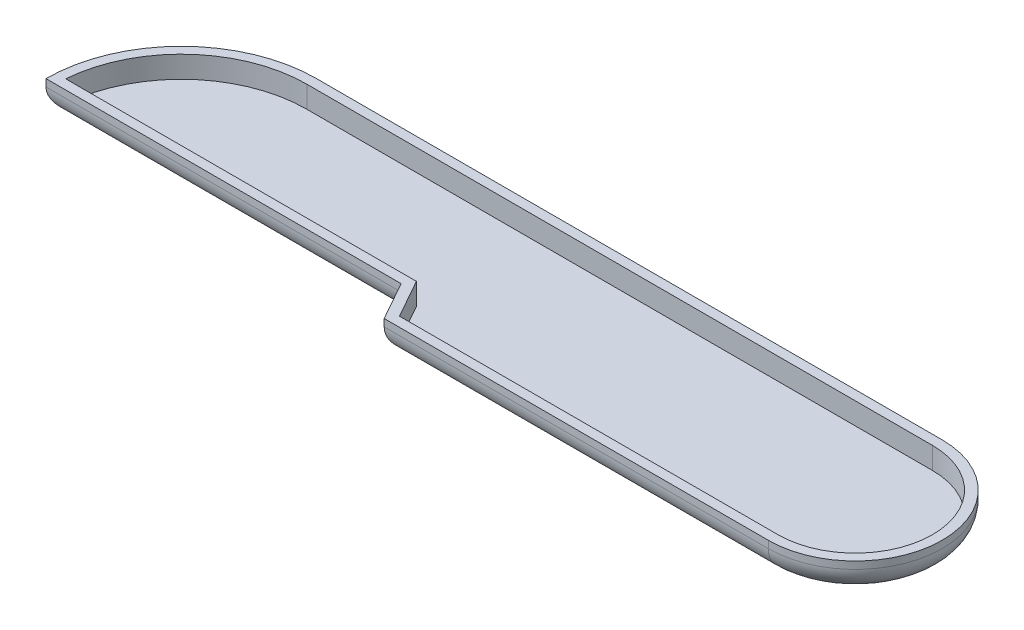
ISO-10303-21;
HEADER;
FILE_DESCRIPTION(('STEP AP214'),'2;1');
FILE_NAME('part.step','',(''),(''),'','','');
FILE_SCHEMA(('AUTOMOTIVE_DESIGN { 1 0 10303 214 1 1 1 1 }'));
ENDSEC;
DATA;
#1=APPLICATION_CONTEXT('core data for automotive mechanical design processes');
#2=APPLICATION_PROTOCOL_DEFINITION('international standard','automotive_design',2000,#1);
#3=PRODUCT_CONTEXT('',#1,'mechanical');
#4=PRODUCT('Part','Part','',(#3));
#5=PRODUCT_RELATED_PRODUCT_CATEGORY('part','',(#4));
#6=PRODUCT_DEFINITION_FORMATION('','',#4);
#7=PRODUCT_DEFINITION_CONTEXT('part definition',#1,'design');
#8=PRODUCT_DEFINITION('design','',#6,#7);
#9=PRODUCT_DEFINITION_SHAPE('','',#8);
#10=(LENGTH_UNIT() NAMED_UNIT(*) SI_UNIT(.MILLI.,.METRE.));
#11=(NAMED_UNIT(*) PLANE_ANGLE_UNIT() SI_UNIT($,.RADIAN.));
#12=(NAMED_UNIT(*) SI_UNIT($,.STERADIAN.) SOLID_ANGLE_UNIT());
#13=UNCERTAINTY_MEASURE_WITH_UNIT(LENGTH_MEASURE(1.E-05),#10,'distance_accuracy_value','');
#14=(GEOMETRIC_REPRESENTATION_CONTEXT(3) GLOBAL_UNCERTAINTY_ASSIGNED_CONTEXT((#13)) GLOBAL_UNIT_ASSIGNED_CONTEXT((#10,
#11,#12)) REPRESENTATION_CONTEXT('',''));
#15=CARTESIAN_POINT('',(0.,0.,0.));
#16=DIRECTION('',(0.,0.,1.));
#17=DIRECTION('',(1.,0.,0.));
#18=AXIS2_PLACEMENT_3D('',#15,#16,#17);
#19=CARTESIAN_POINT('',(0.,3.302,14.224));
#20=DIRECTION('',(0.,-1.,0.));
#21=DIRECTION('',(0.,0.,-1.));
#22=AXIS2_PLACEMENT_3D('',#19,#20,#21);
#23=CYLINDRICAL_SURFACE('',#22,14.224);
#24=DIRECTION('',(0.,-1.,0.));
#25=VECTOR('',#24,1.);
#26=CARTESIAN_POINT('',(0.,3.302,0.));
#27=LINE('',#26,#25);
#28=CARTESIAN_POINT('',(0.,3.302,0.));
#29=VERTEX_POINT('',#28);
#30=CARTESIAN_POINT('',(0.,2.54,0.));
#31=VERTEX_POINT('',#30);
#32=EDGE_CURVE('E244',#29,#31,#27,.T.);
#33=ORIENTED_EDGE('',*,*,#32,.T.);
#34=CARTESIAN_POINT('',(0.,2.54,14.224));
#35=DIRECTION('',(0.,1.,0.));
#36=DIRECTION('',(0.,0.,1.));
#37=AXIS2_PLACEMENT_3D('',#34,#35,#36);
#38=CIRCLE('',#37,14.224);
#39=CARTESIAN_POINT('',(-14.224,2.54,14.224));
#40=VERTEX_POINT('',#39);
#41=EDGE_CURVE('E11',#31,#40,#38,.T.);
#42=ORIENTED_EDGE('',*,*,#41,.T.);
#43=DIRECTION('',(0.,-1.,0.));
#44=VECTOR('',#43,1.);
#45=CARTESIAN_POINT('',(-14.224,3.302,14.224));
#46=LINE('',#45,#44);
#47=CARTESIAN_POINT('',(-14.224,3.302,14.224));
#48=VERTEX_POINT('',#47);
#49=EDGE_CURVE('E261',#48,#40,#46,.T.);
#50=ORIENTED_EDGE('',*,*,#49,.F.);
#51=CARTESIAN_POINT('',(0.,3.302,14.224));
#52=DIRECTION('',(0.,1.,0.));
#53=DIRECTION('',(0.,0.,1.));
#54=AXIS2_PLACEMENT_3D('',#51,#52,#53);
#55=CIRCLE('',#54,14.224);
#56=EDGE_CURVE('E225',#29,#48,#55,.T.);
#57=ORIENTED_EDGE('',*,*,#56,.F.);
#58=EDGE_LOOP('',(#33,#42,#50,#57));
#59=FACE_BOUND('',#58,.T.);
#60=ADVANCED_FACE('F45',(#59),#23,.T.);
#61=CARTESIAN_POINT('',(23.114,3.302,14.224));
#62=DIRECTION('',(0.,0.,-1.));
#63=DIRECTION('',(-1.,0.,0.));
#64=AXIS2_PLACEMENT_3D('',#61,#62,#63);
#65=PLANE('',#64);
#66=ORIENTED_EDGE('',*,*,#49,.T.);
#67=DIRECTION('',(1.,0.,0.));
#68=VECTOR('',#67,1.);
#69=CARTESIAN_POINT('',(23.114,2.54,14.224));
#70=LINE('',#69,#68);
#71=CARTESIAN_POINT('',(23.114,2.54,14.224));
#72=VERTEX_POINT('',#71);
#73=EDGE_CURVE('E265',#40,#72,#70,.T.);
#74=ORIENTED_EDGE('',*,*,#73,.T.);
#75=DIRECTION('',(0.,-1.,0.));
#76=VECTOR('',#75,1.);
#77=CARTESIAN_POINT('',(23.114,3.302,14.224));
#78=LINE('',#77,#76);
#79=CARTESIAN_POINT('',(23.114,3.302,14.224));
#80=VERTEX_POINT('',#79);
#81=EDGE_CURVE('E257',#80,#72,#78,.T.);
#82=ORIENTED_EDGE('',*,*,#81,.F.);
#83=DIRECTION('',(1.,0.,0.));
#84=VECTOR('',#83,1.);
#85=CARTESIAN_POINT('',(23.114,3.302,14.224));
#86=LINE('',#85,#84);
#87=EDGE_CURVE('E229',#48,#80,#86,.T.);
#88=ORIENTED_EDGE('',*,*,#87,.F.);
#89=EDGE_LOOP('',(#66,#74,#82,#88));
#90=FACE_BOUND('',#89,.T.);
#91=ADVANCED_FACE('F336',(#90),#65,.F.);
#92=CARTESIAN_POINT('',(25.4,3.302,18.288));
#93=DIRECTION('',(0.871575537124548,0.,-0.490261239632561));
#94=DIRECTION('',(-0.490261239632561,0.,-0.871575537124548));
#95=AXIS2_PLACEMENT_3D('',#92,#93,#94);
#96=PLANE('',#95);
#97=ORIENTED_EDGE('',*,*,#81,.T.);
#98=DIRECTION('',(0.490261239632561,0.,0.871575537124548));
#99=VECTOR('',#98,1.);
#100=CARTESIAN_POINT('',(25.4,2.54,18.288));
#101=LINE('',#100,#99);
#102=CARTESIAN_POINT('',(25.4,2.54,18.288));
#103=VERTEX_POINT('',#102);
#104=EDGE_CURVE('E288',#72,#103,#101,.T.);
#105=ORIENTED_EDGE('',*,*,#104,.T.);
#106=DIRECTION('',(0.,-1.,0.));
#107=VECTOR('',#106,1.);
#108=CARTESIAN_POINT('',(25.4,3.302,18.288));
#109=LINE('',#108,#107);
#110=CARTESIAN_POINT('',(25.4,3.302,18.288));
#111=VERTEX_POINT('',#110);
#112=EDGE_CURVE('E253',#111,#103,#109,.T.);
#113=ORIENTED_EDGE('',*,*,#112,.F.);
#114=DIRECTION('',(0.490261239632561,0.,0.871575537124548));
#115=VECTOR('',#114,1.);
#116=CARTESIAN_POINT('',(25.4,3.302,18.288));
#117=LINE('',#116,#115);
#118=EDGE_CURVE('E232',#80,#111,#117,.T.);
#119=ORIENTED_EDGE('',*,*,#118,.F.);
#120=EDGE_LOOP('',(#97,#105,#113,#119));
#121=FACE_BOUND('',#120,.T.);
#122=ADVANCED_FACE('F341',(#121),#96,.F.);
#123=CARTESIAN_POINT('',(65.786,3.302,18.288));
#124=DIRECTION('',(0.,0.,-1.));
#125=DIRECTION('',(-1.,0.,0.));
#126=AXIS2_PLACEMENT_3D('',#123,#124,#125);
#127=PLANE('',#126);
#128=ORIENTED_EDGE('',*,*,#112,.T.);
#129=DIRECTION('',(1.,0.,0.));
#130=VECTOR('',#129,1.);
#131=CARTESIAN_POINT('',(65.786,2.54,18.288));
#132=LINE('',#131,#130);
#133=CARTESIAN_POINT('',(65.786,2.54,18.288));
#134=VERTEX_POINT('',#133);
#135=EDGE_CURVE('E291',#103,#134,#132,.T.);
#136=ORIENTED_EDGE('',*,*,#135,.T.);
#137=DIRECTION('',(0.,-1.,0.));
#138=VECTOR('',#137,1.);
#139=CARTESIAN_POINT('',(65.786,3.302,18.288));
#140=LINE('',#139,#138);
#141=CARTESIAN_POINT('',(65.786,3.302,18.288));
#142=VERTEX_POINT('',#141);
#143=EDGE_CURVE('E250',#142,#134,#140,.T.);
#144=ORIENTED_EDGE('',*,*,#143,.F.);
#145=DIRECTION('',(1.,0.,0.));
#146=VECTOR('',#145,1.);
#147=CARTESIAN_POINT('',(65.786,3.302,18.288));
#148=LINE('',#147,#146);
#149=EDGE_CURVE('E235',#111,#142,#148,.T.);
#150=ORIENTED_EDGE('',*,*,#149,.F.);
#151=EDGE_LOOP('',(#128,#136,#144,#150));
#152=FACE_BOUND('',#151,.T.);
#153=ADVANCED_FACE('F347',(#152),#127,.F.);
#154=CARTESIAN_POINT('',(65.786,3.302,9.14399999999998));
#155=DIRECTION('',(0.,-1.,0.));
#156=DIRECTION('',(0.,0.,-1.));
#157=AXIS2_PLACEMENT_3D('',#154,#155,#156);
#158=CYLINDRICAL_SURFACE('',#157,9.144);
#159=ORIENTED_EDGE('',*,*,#143,.T.);
#160=CARTESIAN_POINT('',(65.786,2.54,9.14399999999998));
#161=DIRECTION('',(0.,1.,0.));
#162=DIRECTION('',(0.,0.,1.));
#163=AXIS2_PLACEMENT_3D('',#160,#161,#162);
#164=CIRCLE('',#163,9.144);
#165=CARTESIAN_POINT('',(65.786,2.54,0.));
#166=VERTEX_POINT('',#165);
#167=EDGE_CURVE('E70',#134,#166,#164,.T.);
#168=ORIENTED_EDGE('',*,*,#167,.T.);
#169=DIRECTION('',(0.,-1.,0.));
#170=VECTOR('',#169,1.);
#171=CARTESIAN_POINT('',(65.786,3.302,0.));
#172=LINE('',#171,#170);
#173=CARTESIAN_POINT('',(65.786,3.302,0.));
#174=VERTEX_POINT('',#173);
#175=EDGE_CURVE('E247',#174,#166,#172,.T.);
#176=ORIENTED_EDGE('',*,*,#175,.F.);
#177=CARTESIAN_POINT('',(65.786,3.302,9.14399999999998));
#178=DIRECTION('',(0.,1.,0.));
#179=DIRECTION('',(0.,0.,-1.));
#180=AXIS2_PLACEMENT_3D('',#177,#178,#179);
#181=CIRCLE('',#180,9.144);
#182=EDGE_CURVE('E238',#142,#174,#181,.T.);
#183=ORIENTED_EDGE('',*,*,#182,.F.);
#184=EDGE_LOOP('',(#159,#168,#176,#183));
#185=FACE_BOUND('',#184,.T.);
#186=ADVANCED_FACE('F351',(#185),#158,.T.);
#187=CARTESIAN_POINT('',(0.,3.302,0.));
#188=DIRECTION('',(0.,0.,1.));
#189=DIRECTION('',(1.,0.,0.));
#190=AXIS2_PLACEMENT_3D('',#187,#188,#189);
#191=PLANE('',#190);
#192=ORIENTED_EDGE('',*,*,#175,.T.);
#193=DIRECTION('',(-1.,0.,0.));
#194=VECTOR('',#193,1.);
#195=CARTESIAN_POINT('',(0.,2.54,0.));
#196=LINE('',#195,#194);
#197=EDGE_CURVE('E55',#166,#31,#196,.T.);
#198=ORIENTED_EDGE('',*,*,#197,.T.);
#199=ORIENTED_EDGE('',*,*,#32,.F.);
#200=DIRECTION('',(-1.,0.,0.));
#201=VECTOR('',#200,1.);
#202=CARTESIAN_POINT('',(0.,3.302,0.));
#203=LINE('',#202,#201);
#204=EDGE_CURVE('E241',#174,#29,#203,.T.);
#205=ORIENTED_EDGE('',*,*,#204,.F.);
#206=EDGE_LOOP('',(#192,#198,#199,#205));
#207=FACE_BOUND('',#206,.T.);
#208=ADVANCED_FACE('F355',(#207),#191,.F.);
#209=CARTESIAN_POINT('',(0.,3.302,14.224));
#210=DIRECTION('',(0.,1.,0.));
#211=DIRECTION('',(0.,0.,1.));
#212=AXIS2_PLACEMENT_3D('',#209,#210,#211);
#213=PLANE('',#212);
#214=CARTESIAN_POINT('',(0.,3.302,14.224));
#215=DIRECTION('',(0.,1.,0.));
#216=DIRECTION('',(0.,0.,1.));
#217=AXIS2_PLACEMENT_3D('',#214,#215,#216);
#218=CIRCLE('',#217,13.208);
#219=CARTESIAN_POINT('',(0.,3.302,1.016));
#220=VERTEX_POINT('',#219);
#221=CARTESIAN_POINT('',(-13.1688650991648,3.302,13.208));
#222=VERTEX_POINT('',#221);
#223=EDGE_CURVE('E207',#220,#222,#218,.T.);
#224=ORIENTED_EDGE('',*,*,#223,.F.);
#225=DIRECTION('',(-1.,0.,0.));
#226=VECTOR('',#225,1.);
#227=CARTESIAN_POINT('',(0.,3.302,1.016));
#228=LINE('',#227,#226);
#229=CARTESIAN_POINT('',(65.786,3.302,1.01599999999998));
#230=VERTEX_POINT('',#229);
#231=EDGE_CURVE('E222',#230,#220,#228,.T.);
#232=ORIENTED_EDGE('',*,*,#231,.F.);
#233=CARTESIAN_POINT('',(65.786,3.302,9.14399999999998));
#234=DIRECTION('',(0.,1.,0.));
#235=DIRECTION('',(0.,0.,1.));
#236=AXIS2_PLACEMENT_3D('',#233,#234,#235);
#237=CIRCLE('',#236,8.128);
#238=CARTESIAN_POINT('',(65.786,3.302,17.272));
#239=VERTEX_POINT('',#238);
#240=EDGE_CURVE('E218',#239,#230,#237,.T.);
#241=ORIENTED_EDGE('',*,*,#240,.F.);
#242=DIRECTION('',(1.,0.,0.));
#243=VECTOR('',#242,1.);
#244=CARTESIAN_POINT('',(65.786,3.302,17.272));
#245=LINE('',#244,#243);
#246=CARTESIAN_POINT('',(25.9942050441685,3.302,17.272));
#247=VERTEX_POINT('',#246);
#248=EDGE_CURVE('E215',#247,#239,#245,.T.);
#249=ORIENTED_EDGE('',*,*,#248,.F.);
#250=DIRECTION('',(0.490261239632561,0.,0.871575537124548));
#251=VECTOR('',#250,1.);
#252=CARTESIAN_POINT('',(26.2855207457185,3.302,17.7898945805333));
#253=LINE('',#252,#251);
#254=CARTESIAN_POINT('',(23.7082050441685,3.302,13.208));
#255=VERTEX_POINT('',#254);
#256=EDGE_CURVE('E212',#255,#247,#253,.T.);
#257=ORIENTED_EDGE('',*,*,#256,.F.);
#258=DIRECTION('',(1.,0.,0.));
#259=VECTOR('',#258,1.);
#260=CARTESIAN_POINT('',(23.114,3.302,13.208));
#261=LINE('',#260,#259);
#262=EDGE_CURVE('E172',#222,#255,#261,.T.);
#263=ORIENTED_EDGE('',*,*,#262,.F.);
#264=EDGE_LOOP('',(#224,#232,#241,#249,#257,#263));
#265=FACE_BOUND('',#264,.T.);
#266=ORIENTED_EDGE('',*,*,#56,.T.);
#267=ORIENTED_EDGE('',*,*,#87,.T.);
#268=ORIENTED_EDGE('',*,*,#118,.T.);
#269=ORIENTED_EDGE('',*,*,#149,.T.);
#270=ORIENTED_EDGE('',*,*,#182,.T.);
#271=ORIENTED_EDGE('',*,*,#204,.T.);
#272=EDGE_LOOP('',(#266,#267,#268,#269,#270,#271));
#273=FACE_BOUND('',#272,.T.);
#274=ADVANCED_FACE('F358',(#265,#273),#213,.T.);
#275=CARTESIAN_POINT('',(0.,0.,14.224));
#276=DIRECTION('',(0.,1.,0.));
#277=DIRECTION('',(0.,0.,1.));
#278=AXIS2_PLACEMENT_3D('',#275,#276,#277);
#279=PLANE('',#278);
#280=DIRECTION('',(0.490261239632561,0.,0.871575537124548));
#281=VECTOR('',#280,1.);
#282=CARTESIAN_POINT('',(19.7722113598453,0.,3.10213111008698));
#283=LINE('',#282,#281);
#284=CARTESIAN_POINT('',(26.8855126104214,0.,15.748));
#285=VERTEX_POINT('',#284);
#286=CARTESIAN_POINT('',(24.5995126104214,0.,11.684));
#287=VERTEX_POINT('',#286);
#288=EDGE_CURVE('E281',#285,#287,#283,.F.);
#289=ORIENTED_EDGE('',*,*,#288,.T.);
#290=DIRECTION('',(1.,0.,0.));
#291=VECTOR('',#290,1.);
#292=CARTESIAN_POINT('',(0.,0.,11.684));
#293=LINE('',#292,#291);
#294=CARTESIAN_POINT('',(-11.404571714887,0.,11.684));
#295=VERTEX_POINT('',#294);
#296=EDGE_CURVE('E284',#287,#295,#293,.F.);
#297=ORIENTED_EDGE('',*,*,#296,.T.);
#298=CARTESIAN_POINT('',(0.,0.,14.224));
#299=DIRECTION('',(0.,1.,0.));
#300=DIRECTION('',(0.,0.,1.));
#301=AXIS2_PLACEMENT_3D('',#298,#299,#300);
#302=CIRCLE('',#301,11.684);
#303=CARTESIAN_POINT('',(0.,0.,2.54));
#304=VERTEX_POINT('',#303);
#305=EDGE_CURVE('E269',#295,#304,#302,.F.);
#306=ORIENTED_EDGE('',*,*,#305,.T.);
#307=DIRECTION('',(-1.,0.,0.));
#308=VECTOR('',#307,1.);
#309=CARTESIAN_POINT('',(0.,0.,2.54));
#310=LINE('',#309,#308);
#311=CARTESIAN_POINT('',(65.786,0.,2.53999999999998));
#312=VERTEX_POINT('',#311);
#313=EDGE_CURVE('E272',#304,#312,#310,.F.);
#314=ORIENTED_EDGE('',*,*,#313,.T.);
#315=CARTESIAN_POINT('',(65.786,0.,9.14399999999998));
#316=DIRECTION('',(0.,1.,0.));
#317=DIRECTION('',(0.,0.,1.));
#318=AXIS2_PLACEMENT_3D('',#315,#316,#317);
#319=CIRCLE('',#318,6.604);
#320=CARTESIAN_POINT('',(65.786,0.,15.748));
#321=VERTEX_POINT('',#320);
#322=EDGE_CURVE('E275',#312,#321,#319,.F.);
#323=ORIENTED_EDGE('',*,*,#322,.T.);
#324=DIRECTION('',(1.,0.,0.));
#325=VECTOR('',#324,1.);
#326=CARTESIAN_POINT('',(0.,0.,15.748));
#327=LINE('',#326,#325);
#328=EDGE_CURVE('E278',#321,#285,#327,.F.);
#329=ORIENTED_EDGE('',*,*,#328,.T.);
#330=EDGE_LOOP('',(#289,#297,#306,#314,#323,#329));
#331=FACE_BOUND('',#330,.T.);
#332=ADVANCED_FACE('F359',(#331),#279,.F.);
#333=CARTESIAN_POINT('',(0.,3.302,14.224));
#334=DIRECTION('',(0.,-1.,0.));
#335=DIRECTION('',(0.,0.,-1.));
#336=AXIS2_PLACEMENT_3D('',#333,#334,#335);
#337=CYLINDRICAL_SURFACE('',#336,13.208);
#338=CARTESIAN_POINT('',(0.,1.016,14.224));
#339=DIRECTION('',(0.,1.,0.));
#340=DIRECTION('',(0.,0.,1.));
#341=AXIS2_PLACEMENT_3D('',#338,#339,#340);
#342=CIRCLE('',#341,13.208);
#343=CARTESIAN_POINT('',(0.,1.016,1.016));
#344=VERTEX_POINT('',#343);
#345=CARTESIAN_POINT('',(-13.1688650991648,1.016,13.208));
#346=VERTEX_POINT('',#345);
#347=EDGE_CURVE('E162',#344,#346,#342,.T.);
#348=ORIENTED_EDGE('',*,*,#347,.F.);
#349=DIRECTION('',(0.,-1.,0.));
#350=VECTOR('',#349,1.);
#351=CARTESIAN_POINT('',(0.,3.302,1.016));
#352=LINE('',#351,#350);
#353=EDGE_CURVE('E204',#220,#344,#352,.T.);
#354=ORIENTED_EDGE('',*,*,#353,.F.);
#355=ORIENTED_EDGE('',*,*,#223,.T.);
#356=DIRECTION('',(0.,-1.,0.));
#357=VECTOR('',#356,1.);
#358=CARTESIAN_POINT('',(-13.1688650991648,3.302,13.208));
#359=LINE('',#358,#357);
#360=EDGE_CURVE('E176',#222,#346,#359,.T.);
#361=ORIENTED_EDGE('',*,*,#360,.T.);
#362=EDGE_LOOP('',(#348,#354,#355,#361));
#363=FACE_BOUND('',#362,.T.);
#364=ADVANCED_FACE('F362',(#363),#337,.F.);
#365=CARTESIAN_POINT('',(23.114,3.302,13.208));
#366=DIRECTION('',(0.,0.,-1.));
#367=DIRECTION('',(-1.,0.,0.));
#368=AXIS2_PLACEMENT_3D('',#365,#366,#367);
#369=PLANE('',#368);
#370=DIRECTION('',(1.,0.,0.));
#371=VECTOR('',#370,1.);
#372=CARTESIAN_POINT('',(23.114,1.016,13.208));
#373=LINE('',#372,#371);
#374=CARTESIAN_POINT('',(23.7082050441685,1.016,13.208));
#375=VERTEX_POINT('',#374);
#376=EDGE_CURVE('E155',#346,#375,#373,.T.);
#377=ORIENTED_EDGE('',*,*,#376,.F.);
#378=ORIENTED_EDGE('',*,*,#360,.F.);
#379=ORIENTED_EDGE('',*,*,#262,.T.);
#380=DIRECTION('',(0.,-1.,0.));
#381=VECTOR('',#380,1.);
#382=CARTESIAN_POINT('',(23.7082050441685,3.302,13.208));
#383=LINE('',#382,#381);
#384=EDGE_CURVE('E169',#255,#375,#383,.T.);
#385=ORIENTED_EDGE('',*,*,#384,.T.);
#386=EDGE_LOOP('',(#377,#378,#379,#385));
#387=FACE_BOUND('',#386,.T.);
#388=ADVANCED_FACE('F170',(#387),#369,.T.);
#389=CARTESIAN_POINT('',(26.2855207457185,3.302,17.7898945805333));
#390=DIRECTION('',(0.871575537124548,0.,-0.490261239632561));
#391=DIRECTION('',(-0.490261239632561,0.,-0.871575537124548));
#392=AXIS2_PLACEMENT_3D('',#389,#390,#391);
#393=PLANE('',#392);
#394=DIRECTION('',(0.490261239632561,0.,0.871575537124548));
#395=VECTOR('',#394,1.);
#396=CARTESIAN_POINT('',(26.2855207457185,1.016,17.7898945805333));
#397=LINE('',#396,#395);
#398=CARTESIAN_POINT('',(25.9942050441685,1.016,17.272));
#399=VERTEX_POINT('',#398);
#400=EDGE_CURVE('E159',#375,#399,#397,.T.);
#401=ORIENTED_EDGE('',*,*,#400,.F.);
#402=ORIENTED_EDGE('',*,*,#384,.F.);
#403=ORIENTED_EDGE('',*,*,#256,.T.);
#404=DIRECTION('',(0.,-1.,0.));
#405=VECTOR('',#404,1.);
#406=CARTESIAN_POINT('',(25.9942050441685,3.302,17.272));
#407=LINE('',#406,#405);
#408=EDGE_CURVE('E177',#247,#399,#407,.T.);
#409=ORIENTED_EDGE('',*,*,#408,.T.);
#410=EDGE_LOOP('',(#401,#402,#403,#409));
#411=FACE_BOUND('',#410,.T.);
#412=ADVANCED_FACE('F179',(#411),#393,.T.);
#413=CARTESIAN_POINT('',(65.786,3.302,17.272));
#414=DIRECTION('',(0.,0.,-1.));
#415=DIRECTION('',(-1.,0.,0.));
#416=AXIS2_PLACEMENT_3D('',#413,#414,#415);
#417=PLANE('',#416);
#418=DIRECTION('',(1.,0.,0.));
#419=VECTOR('',#418,1.);
#420=CARTESIAN_POINT('',(65.786,1.016,17.272));
#421=LINE('',#420,#419);
#422=CARTESIAN_POINT('',(65.786,1.016,17.272));
#423=VERTEX_POINT('',#422);
#424=EDGE_CURVE('E183',#399,#423,#421,.T.);
#425=ORIENTED_EDGE('',*,*,#424,.F.);
#426=ORIENTED_EDGE('',*,*,#408,.F.);
#427=ORIENTED_EDGE('',*,*,#248,.T.);
#428=DIRECTION('',(0.,-1.,0.));
#429=VECTOR('',#428,1.);
#430=CARTESIAN_POINT('',(65.786,3.302,17.272));
#431=LINE('',#430,#429);
#432=EDGE_CURVE('E192',#239,#423,#431,.T.);
#433=ORIENTED_EDGE('',*,*,#432,.T.);
#434=EDGE_LOOP('',(#425,#426,#427,#433));
#435=FACE_BOUND('',#434,.T.);
#436=ADVANCED_FACE('F376',(#435),#417,.T.);
#437=CARTESIAN_POINT('',(65.786,3.302,9.14399999999998));
#438=DIRECTION('',(0.,-1.,0.));
#439=DIRECTION('',(0.,0.,-1.));
#440=AXIS2_PLACEMENT_3D('',#437,#438,#439);
#441=CYLINDRICAL_SURFACE('',#440,8.128);
#442=CARTESIAN_POINT('',(65.786,1.016,9.14399999999998));
#443=DIRECTION('',(0.,1.,0.));
#444=DIRECTION('',(0.,0.,1.));
#445=AXIS2_PLACEMENT_3D('',#442,#443,#444);
#446=CIRCLE('',#445,8.128);
#447=CARTESIAN_POINT('',(65.786,1.016,1.01599999999998));
#448=VERTEX_POINT('',#447);
#449=EDGE_CURVE('E188',#423,#448,#446,.T.);
#450=ORIENTED_EDGE('',*,*,#449,.F.);
#451=ORIENTED_EDGE('',*,*,#432,.F.);
#452=ORIENTED_EDGE('',*,*,#240,.T.);
#453=DIRECTION('',(0.,1.,0.));
#454=VECTOR('',#453,1.);
#455=CARTESIAN_POINT('',(65.786,3.302,1.01599999999998));
#456=LINE('',#455,#454);
#457=EDGE_CURVE('E197',#230,#448,#456,.F.);
#458=ORIENTED_EDGE('',*,*,#457,.T.);
#459=EDGE_LOOP('',(#450,#451,#452,#458));
#460=FACE_BOUND('',#459,.T.);
#461=ADVANCED_FACE('F372',(#460),#441,.F.);
#462=CARTESIAN_POINT('',(0.,3.302,1.016));
#463=DIRECTION('',(0.,0.,1.));
#464=DIRECTION('',(1.,0.,0.));
#465=AXIS2_PLACEMENT_3D('',#462,#463,#464);
#466=PLANE('',#465);
#467=DIRECTION('',(-1.,0.,0.));
#468=VECTOR('',#467,1.);
#469=CARTESIAN_POINT('',(0.,1.016,1.016));
#470=LINE('',#469,#468);
#471=EDGE_CURVE('E200',#448,#344,#470,.T.);
#472=ORIENTED_EDGE('',*,*,#471,.F.);
#473=ORIENTED_EDGE('',*,*,#457,.F.);
#474=ORIENTED_EDGE('',*,*,#231,.T.);
#475=ORIENTED_EDGE('',*,*,#353,.T.);
#476=EDGE_LOOP('',(#472,#473,#474,#475));
#477=FACE_BOUND('',#476,.T.);
#478=ADVANCED_FACE('F369',(#477),#466,.T.);
#479=CARTESIAN_POINT('',(0.,1.016,14.224));
#480=DIRECTION('',(0.,1.,0.));
#481=DIRECTION('',(0.,0.,1.));
#482=AXIS2_PLACEMENT_3D('',#479,#480,#481);
#483=PLANE('',#482);
#484=ORIENTED_EDGE('',*,*,#347,.T.);
#485=ORIENTED_EDGE('',*,*,#376,.T.);
#486=ORIENTED_EDGE('',*,*,#400,.T.);
#487=ORIENTED_EDGE('',*,*,#424,.T.);
#488=ORIENTED_EDGE('',*,*,#449,.T.);
#489=ORIENTED_EDGE('',*,*,#471,.T.);
#490=EDGE_LOOP('',(#484,#485,#486,#487,#488,#489));
#491=FACE_BOUND('',#490,.T.);
#492=ADVANCED_FACE('F157',(#491),#483,.T.);
#493=CARTESIAN_POINT('',(65.786,2.54,9.14399999999998));
#494=DIRECTION('',(0.,1.,0.));
#495=DIRECTION('',(0.,0.,1.));
#496=AXIS2_PLACEMENT_3D('',#493,#494,#495);
#497=TOROIDAL_SURFACE('',#496,6.604,2.54);
#498=CARTESIAN_POINT('',(65.786,2.54,15.748));
#499=DIRECTION('',(-1.,0.,0.));
#500=DIRECTION('',(0.,0.,1.));
#501=AXIS2_PLACEMENT_3D('',#498,#499,#500);
#502=CIRCLE('',#501,2.54);
#503=EDGE_CURVE('E397',#321,#134,#502,.T.);
#504=ORIENTED_EDGE('',*,*,#503,.F.);
#505=ORIENTED_EDGE('',*,*,#322,.F.);
#506=CARTESIAN_POINT('',(65.786,2.54,2.53999999999998));
#507=DIRECTION('',(-1.,0.,0.));
#508=DIRECTION('',(0.,0.,1.));
#509=AXIS2_PLACEMENT_3D('',#506,#507,#508);
#510=CIRCLE('',#509,2.54);
#511=EDGE_CURVE('E49',#166,#312,#510,.T.);
#512=ORIENTED_EDGE('',*,*,#511,.F.);
#513=ORIENTED_EDGE('',*,*,#167,.F.);
#514=EDGE_LOOP('',(#504,#505,#512,#513));
#515=FACE_BOUND('',#514,.T.);
#516=ADVANCED_FACE('F47',(#515),#497,.T.);
#517=CARTESIAN_POINT('',(0.,2.54,2.54));
#518=DIRECTION('',(-1.,0.,0.));
#519=DIRECTION('',(0.,0.,1.));
#520=AXIS2_PLACEMENT_3D('',#517,#518,#519);
#521=CYLINDRICAL_SURFACE('',#520,2.54);
#522=ORIENTED_EDGE('',*,*,#511,.T.);
#523=ORIENTED_EDGE('',*,*,#313,.F.);
#524=CARTESIAN_POINT('',(0.,2.54,2.54));
#525=DIRECTION('',(-1.,0.,0.));
#526=DIRECTION('',(0.,0.,1.));
#527=AXIS2_PLACEMENT_3D('',#524,#525,#526);
#528=CIRCLE('',#527,2.54);
#529=EDGE_CURVE('E437',#31,#304,#528,.T.);
#530=ORIENTED_EDGE('',*,*,#529,.F.);
#531=ORIENTED_EDGE('',*,*,#197,.F.);
#532=EDGE_LOOP('',(#522,#523,#530,#531));
#533=FACE_BOUND('',#532,.T.);
#534=ADVANCED_FACE('F326',(#533),#521,.T.);
#535=CARTESIAN_POINT('',(65.786,2.54,15.748));
#536=DIRECTION('',(1.,0.,0.));
#537=DIRECTION('',(0.,0.,-1.));
#538=AXIS2_PLACEMENT_3D('',#535,#536,#537);
#539=CYLINDRICAL_SURFACE('',#538,2.54);
#540=ORIENTED_EDGE('',*,*,#503,.T.);
#541=ORIENTED_EDGE('',*,*,#135,.F.);
#542=CARTESIAN_POINT('',(26.8855126104214,2.54,15.748));
#543=DIRECTION('',(0.863209487793247,0.,0.504845897461512));
#544=DIRECTION('',(0.504845897461512,0.,-0.863209487793247));
#545=AXIS2_PLACEMENT_3D('',#542,#543,#544);
#546=ELLIPSE('',#545,2.94250704599342,2.54);
#547=EDGE_CURVE('E310',#285,#103,#546,.F.);
#548=ORIENTED_EDGE('',*,*,#547,.F.);
#549=ORIENTED_EDGE('',*,*,#328,.F.);
#550=EDGE_LOOP('',(#540,#541,#548,#549));
#551=FACE_BOUND('',#550,.T.);
#552=ADVANCED_FACE('F320',(#551),#539,.T.);
#553=CARTESIAN_POINT('',(0.,2.54,14.224));
#554=DIRECTION('',(0.,1.,0.));
#555=DIRECTION('',(0.,0.,1.));
#556=AXIS2_PLACEMENT_3D('',#553,#554,#555);
#557=TOROIDAL_SURFACE('',#556,11.684,2.54);
#558=ORIENTED_EDGE('',*,*,#529,.T.);
#559=ORIENTED_EDGE('',*,*,#305,.F.);
#560=CARTESIAN_POINT('',(-14.224,2.54,14.224));
#561=CARTESIAN_POINT('',(-14.2240123049099,2.48349170453296,14.2240138374965));
#562=CARTESIAN_POINT('',(-14.2221146844449,2.42699331091816,14.2221147179371));
#563=CARTESIAN_POINT('',(-14.2145945070152,2.31453298488381,14.214596713936));
#564=CARTESIAN_POINT('',(-14.2089745854956,2.25857070130849,14.2089804612825));
#565=CARTESIAN_POINT('',(-14.1941639524935,2.14806176236712,14.194193448156));
#566=CARTESIAN_POINT('',(-14.1850021656048,2.09350736376063,14.1850514817911));
#567=CARTESIAN_POINT('',(-14.1632802655713,1.9857698522351,14.1634057171879));
#568=CARTESIAN_POINT('',(-14.1507197283758,1.93258691133576,14.1509014994538));
#569=CARTESIAN_POINT('',(-14.1083081971507,1.77591474161307,14.1087505267741));
#570=CARTESIAN_POINT('',(-14.0736735227425,1.67491552037475,14.0744114439504));
#571=CARTESIAN_POINT('',(-13.9935465539626,1.48160495308317,13.995357025601));
#572=CARTESIAN_POINT('',(-13.9480317889805,1.3893121458938,13.9506202210703));
#573=CARTESIAN_POINT('',(-13.8288526886476,1.18074776745042,13.8341742273914));
#574=CARTESIAN_POINT('',(-13.7510947574899,1.06890780603682,13.7587091408721));
#575=CARTESIAN_POINT('',(-13.5829338755967,0.864103307852109,13.5971300233014));
#576=CARTESIAN_POINT('',(-13.4925084175002,0.771173106496163,13.5109970701158));
#577=CARTESIAN_POINT('',(-13.2627542645587,0.568246624733263,13.2946005037849));
#578=CARTESIAN_POINT('',(-13.1187409173112,0.46725682406435,13.1608952607711));
#579=CARTESIAN_POINT('',(-12.8185322452492,0.297231743893499,12.8871721374926));
#580=CARTESIAN_POINT('',(-12.6623163263173,0.228251910598399,12.7471437614108));
#581=CARTESIAN_POINT('',(-12.3276205208559,0.113609992668701,12.4529660351944));
#582=CARTESIAN_POINT('',(-12.1483956056686,0.0705636303999512,12.2986672815841));
#583=CARTESIAN_POINT('',(-11.7841567640955,0.0139751950509922,11.9922453790662));
#584=CARTESIAN_POINT('',(-11.5991530259955,0.000383874277880236,11.8401190218192));
#585=CARTESIAN_POINT('',(-11.4098778626942,2.67901765363938E-06,11.6882551218333));
#586=CARTESIAN_POINT('',(-11.4072249502798,6.66683445300817E-09,11.6861273173591));
#587=CARTESIAN_POINT('',(-11.404571714887,0.,11.684));
#588=B_SPLINE_CURVE_WITH_KNOTS('',3,(#560,#561,#562,#563,#564,#565,#566,#567,#568,#569,#570,
#571,#572,#573,#574,#575,#576,#577,#578,#579,#580,#581,#582,#583,#584,#585,#586,#587),
.UNSPECIFIED.,.F.,.F.,(4,2,2,2,2,2,2,2,2,2,2,2,2,4),(0.,0.169444987774344,0.338770134011416,
0.506740743875983,0.674732320541944,1.00954914684079,1.34506353610282,1.80963212024773,
2.2750368625216,2.93423401086546,3.5945687671125,4.31356296855779,5.03135410901917,
5.04155653090689),.UNSPECIFIED.);
#589=EDGE_CURVE('E301',#40,#295,#588,.T.);
#590=ORIENTED_EDGE('',*,*,#589,.F.);
#591=ORIENTED_EDGE('',*,*,#41,.F.);
#592=EDGE_LOOP('',(#558,#559,#590,#591));
#593=FACE_BOUND('',#592,.T.);
#594=ADVANCED_FACE('F315',(#593),#557,.T.);
#595=CARTESIAN_POINT('',(27.6138018642963,2.54,17.0427364513333));
#596=DIRECTION('',(0.490261239632561,0.,0.871575537124548));
#597=DIRECTION('',(0.871575537124548,0.,-0.490261239632561));
#598=AXIS2_PLACEMENT_3D('',#595,#596,#597);
#599=CYLINDRICAL_SURFACE('',#598,2.54);
#600=ORIENTED_EDGE('',*,*,#547,.T.);
#601=ORIENTED_EDGE('',*,*,#104,.F.);
#602=CARTESIAN_POINT('',(24.5995126104214,2.54,11.684));
#603=DIRECTION('',(0.863209487793247,0.,0.504845897461512));
#604=DIRECTION('',(0.504845897461512,0.,-0.863209487793248));
#605=AXIS2_PLACEMENT_3D('',#602,#603,#604);
#606=ELLIPSE('',#605,2.94250704599342,2.54);
#607=EDGE_CURVE('E298',#287,#72,#606,.F.);
#608=ORIENTED_EDGE('',*,*,#607,.F.);
#609=ORIENTED_EDGE('',*,*,#288,.F.);
#610=EDGE_LOOP('',(#600,#601,#608,#609));
#611=FACE_BOUND('',#610,.T.);
#612=ADVANCED_FACE('F319',(#611),#599,.T.);
#613=CARTESIAN_POINT('',(23.114,2.54,11.684));
#614=DIRECTION('',(1.,0.,0.));
#615=DIRECTION('',(0.,0.,-1.));
#616=AXIS2_PLACEMENT_3D('',#613,#614,#615);
#617=CYLINDRICAL_SURFACE('',#616,2.54);
#618=ORIENTED_EDGE('',*,*,#589,.T.);
#619=ORIENTED_EDGE('',*,*,#296,.F.);
#620=ORIENTED_EDGE('',*,*,#607,.T.);
#621=ORIENTED_EDGE('',*,*,#73,.F.);
#622=EDGE_LOOP('',(#618,#619,#620,#621));
#623=FACE_BOUND('',#622,.T.);
#624=ADVANCED_FACE('F312',(#623),#617,.T.);
#625=CLOSED_SHELL('',(#60,#91,#122,#153,#186,#208,#274,#332,#364,#388,#412,#436,#461,#478,#492,
#516,#534,#552,#594,#612,#624));
#626=MANIFOLD_SOLID_BREP('B2',#625);
#627=ADVANCED_BREP_SHAPE_REPRESENTATION('',(#18,#626),#14);
#628=SHAPE_DEFINITION_REPRESENTATION(#9,#627);
ENDSEC;
END-ISO-10303-21;
